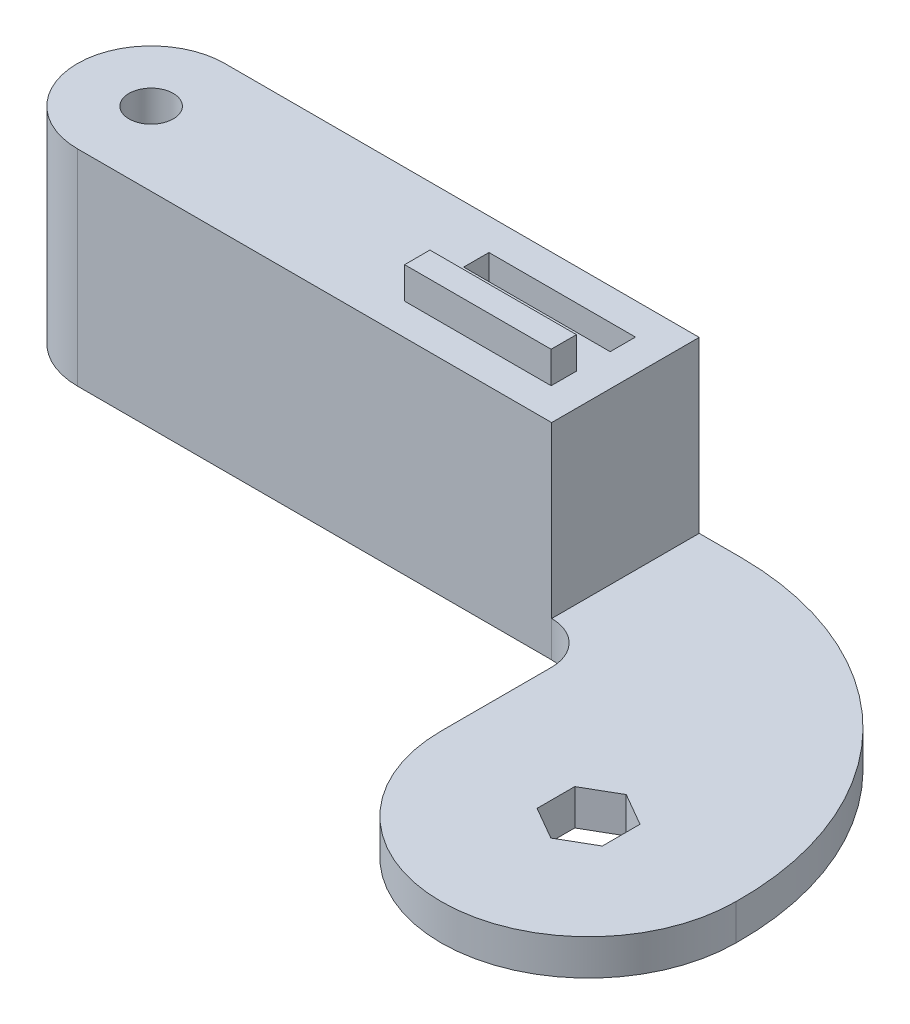
ISO-10303-21;
HEADER;
FILE_DESCRIPTION(('STEP AP214'),'2;1');
FILE_NAME('part.step','',(''),(''),'','','');
FILE_SCHEMA(('AUTOMOTIVE_DESIGN { 1 0 10303 214 1 1 1 1 }'));
ENDSEC;
DATA;
#1=APPLICATION_CONTEXT('core data for automotive mechanical design processes');
#2=APPLICATION_PROTOCOL_DEFINITION('international standard','automotive_design',2000,#1);
#3=PRODUCT_CONTEXT('',#1,'mechanical');
#4=PRODUCT('Part','Part','',(#3));
#5=PRODUCT_RELATED_PRODUCT_CATEGORY('part','',(#4));
#6=PRODUCT_DEFINITION_FORMATION('','',#4);
#7=PRODUCT_DEFINITION_CONTEXT('part definition',#1,'design');
#8=PRODUCT_DEFINITION('design','',#6,#7);
#9=PRODUCT_DEFINITION_SHAPE('','',#8);
#10=(LENGTH_UNIT() NAMED_UNIT(*) SI_UNIT(.MILLI.,.METRE.));
#11=(NAMED_UNIT(*) PLANE_ANGLE_UNIT() SI_UNIT($,.RADIAN.));
#12=(NAMED_UNIT(*) SI_UNIT($,.STERADIAN.) SOLID_ANGLE_UNIT());
#13=UNCERTAINTY_MEASURE_WITH_UNIT(LENGTH_MEASURE(1.E-05),#10,'distance_accuracy_value','');
#14=(GEOMETRIC_REPRESENTATION_CONTEXT(3) GLOBAL_UNCERTAINTY_ASSIGNED_CONTEXT((#13)) GLOBAL_UNIT_ASSIGNED_CONTEXT((#10,
#11,#12)) REPRESENTATION_CONTEXT('',''));
#15=CARTESIAN_POINT('',(0.,0.,0.));
#16=DIRECTION('',(0.,0.,1.));
#17=DIRECTION('',(1.,0.,0.));
#18=AXIS2_PLACEMENT_3D('',#15,#16,#17);
#19=CARTESIAN_POINT('',(0.,6.8,-29.));
#20=DIRECTION('',(0.,0.,1.));
#21=DIRECTION('',(1.,0.,0.));
#22=AXIS2_PLACEMENT_3D('',#19,#20,#21);
#23=PLANE('',#22);
#24=DIRECTION('',(1.,0.,0.));
#25=VECTOR('',#24,1.);
#26=CARTESIAN_POINT('',(-140.,39.,-29.));
#27=LINE('',#26,#25);
#28=CARTESIAN_POINT('',(-126.,39.,-29.));
#29=VERTEX_POINT('',#28);
#30=CARTESIAN_POINT('',(-36.,39.,-29.));
#31=VERTEX_POINT('',#30);
#32=EDGE_CURVE('E328',#29,#31,#27,.T.);
#33=ORIENTED_EDGE('',*,*,#32,.F.);
#34=DIRECTION('',(0.,-1.,0.));
#35=VECTOR('',#34,1.);
#36=CARTESIAN_POINT('',(-126.,6.8,-29.));
#37=LINE('',#36,#35);
#38=CARTESIAN_POINT('',(-126.,0.,-29.));
#39=VERTEX_POINT('',#38);
#40=EDGE_CURVE('E428',#29,#39,#37,.T.);
#41=ORIENTED_EDGE('',*,*,#40,.T.);
#42=DIRECTION('',(-1.,0.,0.));
#43=VECTOR('',#42,1.);
#44=CARTESIAN_POINT('',(0.,0.,-29.));
#45=LINE('',#44,#43);
#46=CARTESIAN_POINT('',(-36.,0.,-29.));
#47=VERTEX_POINT('',#46);
#48=EDGE_CURVE('E362',#47,#39,#45,.T.);
#49=ORIENTED_EDGE('',*,*,#48,.F.);
#50=DIRECTION('',(0.,-1.,0.));
#51=VECTOR('',#50,1.);
#52=CARTESIAN_POINT('',(-36.,6.8,-29.));
#53=LINE('',#52,#51);
#54=CARTESIAN_POINT('',(-36.,6.8,-29.));
#55=VERTEX_POINT('',#54);
#56=EDGE_CURVE('E408',#55,#47,#53,.T.);
#57=ORIENTED_EDGE('',*,*,#56,.F.);
#58=DIRECTION('',(0.,-1.,0.));
#59=VECTOR('',#58,1.);
#60=CARTESIAN_POINT('',(-36.,39.,-29.));
#61=LINE('',#60,#59);
#62=EDGE_CURVE('E339',#31,#55,#61,.T.);
#63=ORIENTED_EDGE('',*,*,#62,.F.);
#64=EDGE_LOOP('',(#33,#41,#49,#57,#63));
#65=FACE_BOUND('',#64,.T.);
#66=ADVANCED_FACE('F37',(#65),#23,.T.);
#67=CARTESIAN_POINT('',(-36.,6.8,-21.));
#68=DIRECTION('',(0.,-1.,0.));
#69=DIRECTION('',(0.,0.,-1.));
#70=AXIS2_PLACEMENT_3D('',#67,#68,#69);
#71=CYLINDRICAL_SURFACE('',#70,8.00000000000001);
#72=CARTESIAN_POINT('',(-36.,0.,-21.));
#73=DIRECTION('',(0.,1.,0.));
#74=DIRECTION('',(0.,0.,1.));
#75=AXIS2_PLACEMENT_3D('',#72,#73,#74);
#76=CIRCLE('',#75,8.00000000000001);
#77=CARTESIAN_POINT('',(-28.,0.,-21.));
#78=VERTEX_POINT('',#77);
#79=EDGE_CURVE('E388',#47,#78,#76,.F.);
#80=ORIENTED_EDGE('',*,*,#79,.T.);
#81=DIRECTION('',(0.,-1.,0.));
#82=VECTOR('',#81,1.);
#83=CARTESIAN_POINT('',(-28.,6.8,-21.));
#84=LINE('',#83,#82);
#85=CARTESIAN_POINT('',(-28.,6.8,-21.));
#86=VERTEX_POINT('',#85);
#87=EDGE_CURVE('E406',#86,#78,#84,.T.);
#88=ORIENTED_EDGE('',*,*,#87,.F.);
#89=CARTESIAN_POINT('',(-36.,6.8,-21.));
#90=DIRECTION('',(0.,1.,0.));
#91=DIRECTION('',(0.,0.,1.));
#92=AXIS2_PLACEMENT_3D('',#89,#90,#91);
#93=CIRCLE('',#92,8.00000000000001);
#94=EDGE_CURVE('E373',#55,#86,#93,.F.);
#95=ORIENTED_EDGE('',*,*,#94,.F.);
#96=ORIENTED_EDGE('',*,*,#56,.T.);
#97=EDGE_LOOP('',(#80,#88,#95,#96));
#98=FACE_BOUND('',#97,.T.);
#99=ADVANCED_FACE('F473',(#98),#71,.F.);
#100=CARTESIAN_POINT('',(-28.,6.8,0.));
#101=DIRECTION('',(-1.,0.,0.));
#102=DIRECTION('',(0.,0.,1.));
#103=AXIS2_PLACEMENT_3D('',#100,#101,#102);
#104=PLANE('',#103);
#105=DIRECTION('',(0.,0.,-1.));
#106=VECTOR('',#105,1.);
#107=CARTESIAN_POINT('',(-28.,0.,0.));
#108=LINE('',#107,#106);
#109=CARTESIAN_POINT('',(-28.,0.,0.));
#110=VERTEX_POINT('',#109);
#111=EDGE_CURVE('E391',#110,#78,#108,.T.);
#112=ORIENTED_EDGE('',*,*,#111,.F.);
#113=DIRECTION('',(0.,-1.,0.));
#114=VECTOR('',#113,1.);
#115=CARTESIAN_POINT('',(-28.,6.8,0.));
#116=LINE('',#115,#114);
#117=CARTESIAN_POINT('',(-28.,6.8,0.));
#118=VERTEX_POINT('',#117);
#119=EDGE_CURVE('E404',#118,#110,#116,.T.);
#120=ORIENTED_EDGE('',*,*,#119,.F.);
#121=DIRECTION('',(0.,0.,-1.));
#122=VECTOR('',#121,1.);
#123=CARTESIAN_POINT('',(-28.,6.8,0.));
#124=LINE('',#123,#122);
#125=EDGE_CURVE('E375',#118,#86,#124,.T.);
#126=ORIENTED_EDGE('',*,*,#125,.T.);
#127=ORIENTED_EDGE('',*,*,#87,.T.);
#128=EDGE_LOOP('',(#112,#120,#126,#127));
#129=FACE_BOUND('',#128,.T.);
#130=ADVANCED_FACE('F478',(#129),#104,.T.);
#131=CARTESIAN_POINT('',(0.,6.8,0.));
#132=DIRECTION('',(0.,-1.,0.));
#133=DIRECTION('',(0.,0.,-1.));
#134=AXIS2_PLACEMENT_3D('',#131,#132,#133);
#135=CYLINDRICAL_SURFACE('',#134,28.);
#136=CARTESIAN_POINT('',(0.,0.,0.));
#137=DIRECTION('',(0.,1.,0.));
#138=DIRECTION('',(0.,0.,1.));
#139=AXIS2_PLACEMENT_3D('',#136,#137,#138);
#140=CIRCLE('',#139,28.);
#141=CARTESIAN_POINT('',(28.,0.,0.));
#142=VERTEX_POINT('',#141);
#143=EDGE_CURVE('E394',#110,#142,#140,.T.);
#144=ORIENTED_EDGE('',*,*,#143,.T.);
#145=DIRECTION('',(0.,-1.,0.));
#146=VECTOR('',#145,1.);
#147=CARTESIAN_POINT('',(28.,6.8,0.));
#148=LINE('',#147,#146);
#149=CARTESIAN_POINT('',(28.,6.8,0.));
#150=VERTEX_POINT('',#149);
#151=EDGE_CURVE('E401',#150,#142,#148,.T.);
#152=ORIENTED_EDGE('',*,*,#151,.F.);
#153=CARTESIAN_POINT('',(0.,6.8,0.));
#154=DIRECTION('',(0.,1.,0.));
#155=DIRECTION('',(0.,0.,1.));
#156=AXIS2_PLACEMENT_3D('',#153,#154,#155);
#157=CIRCLE('',#156,28.);
#158=EDGE_CURVE('E379',#118,#150,#157,.T.);
#159=ORIENTED_EDGE('',*,*,#158,.F.);
#160=ORIENTED_EDGE('',*,*,#119,.T.);
#161=EDGE_LOOP('',(#144,#152,#159,#160));
#162=FACE_BOUND('',#161,.T.);
#163=ADVANCED_FACE('F707',(#162),#135,.T.);
#164=CARTESIAN_POINT('',(-28.1946619349979,6.8,-0.799981256844204));
#165=DIRECTION('',(0.,-1.,0.));
#166=DIRECTION('',(0.,0.,-1.));
#167=AXIS2_PLACEMENT_3D('',#164,#165,#166);
#168=CYLINDRICAL_SURFACE('',#167,56.2003558707594);
#169=CARTESIAN_POINT('',(-28.1946619349979,0.,-0.799981256844204));
#170=DIRECTION('',(0.,1.,0.));
#171=DIRECTION('',(0.,0.,1.));
#172=AXIS2_PLACEMENT_3D('',#169,#170,#171);
#173=CIRCLE('',#172,56.2003558707594);
#174=CARTESIAN_POINT('',(-28.,0.,-57.));
#175=VERTEX_POINT('',#174);
#176=EDGE_CURVE('E396',#142,#175,#173,.T.);
#177=ORIENTED_EDGE('',*,*,#176,.T.);
#178=DIRECTION('',(0.,-1.,0.));
#179=VECTOR('',#178,1.);
#180=CARTESIAN_POINT('',(-28.,6.8,-57.));
#181=LINE('',#180,#179);
#182=CARTESIAN_POINT('',(-28.,6.8,-57.));
#183=VERTEX_POINT('',#182);
#184=EDGE_CURVE('E385',#183,#175,#181,.T.);
#185=ORIENTED_EDGE('',*,*,#184,.F.);
#186=CARTESIAN_POINT('',(-28.1946619349979,6.8,-0.799981256844204));
#187=DIRECTION('',(0.,1.,0.));
#188=DIRECTION('',(0.,0.,1.));
#189=AXIS2_PLACEMENT_3D('',#186,#187,#188);
#190=CIRCLE('',#189,56.2003558707594);
#191=EDGE_CURVE('E381',#150,#183,#190,.T.);
#192=ORIENTED_EDGE('',*,*,#191,.F.);
#193=ORIENTED_EDGE('',*,*,#151,.T.);
#194=EDGE_LOOP('',(#177,#185,#192,#193));
#195=FACE_BOUND('',#194,.T.);
#196=ADVANCED_FACE('F513',(#195),#168,.T.);
#197=CARTESIAN_POINT('',(0.,6.8,-57.));
#198=DIRECTION('',(0.,0.,1.));
#199=DIRECTION('',(1.,0.,0.));
#200=AXIS2_PLACEMENT_3D('',#197,#198,#199);
#201=PLANE('',#200);
#202=DIRECTION('',(-1.,0.,0.));
#203=VECTOR('',#202,1.);
#204=CARTESIAN_POINT('',(0.,0.,-57.));
#205=LINE('',#204,#203);
#206=CARTESIAN_POINT('',(-126.,0.,-57.));
#207=VERTEX_POINT('',#206);
#208=EDGE_CURVE('E376',#175,#207,#205,.T.);
#209=ORIENTED_EDGE('',*,*,#208,.T.);
#210=DIRECTION('',(0.,-1.,0.));
#211=VECTOR('',#210,1.);
#212=CARTESIAN_POINT('',(-126.,39.,-57.));
#213=LINE('',#212,#211);
#214=CARTESIAN_POINT('',(-126.,39.,-57.));
#215=VERTEX_POINT('',#214);
#216=EDGE_CURVE('E11',#207,#215,#213,.F.);
#217=ORIENTED_EDGE('',*,*,#216,.T.);
#218=DIRECTION('',(-1.,0.,0.));
#219=VECTOR('',#218,1.);
#220=CARTESIAN_POINT('',(-140.,39.,-57.));
#221=LINE('',#220,#219);
#222=CARTESIAN_POINT('',(-36.,39.,-57.));
#223=VERTEX_POINT('',#222);
#224=EDGE_CURVE('E332',#223,#215,#221,.T.);
#225=ORIENTED_EDGE('',*,*,#224,.F.);
#226=DIRECTION('',(0.,-1.,0.));
#227=VECTOR('',#226,1.);
#228=CARTESIAN_POINT('',(-36.,39.,-57.));
#229=LINE('',#228,#227);
#230=CARTESIAN_POINT('',(-36.,6.8,-57.));
#231=VERTEX_POINT('',#230);
#232=EDGE_CURVE('E334',#223,#231,#229,.T.);
#233=ORIENTED_EDGE('',*,*,#232,.T.);
#234=DIRECTION('',(-1.,0.,0.));
#235=VECTOR('',#234,1.);
#236=CARTESIAN_POINT('',(0.,6.8,-57.));
#237=LINE('',#236,#235);
#238=EDGE_CURVE('E383',#183,#231,#237,.T.);
#239=ORIENTED_EDGE('',*,*,#238,.F.);
#240=ORIENTED_EDGE('',*,*,#184,.T.);
#241=EDGE_LOOP('',(#209,#217,#225,#233,#239,#240));
#242=FACE_BOUND('',#241,.T.);
#243=ADVANCED_FACE('F508',(#242),#201,.F.);
#244=CARTESIAN_POINT('',(0.,6.8,0.));
#245=DIRECTION('',(0.,1.,0.));
#246=DIRECTION('',(0.,0.,1.));
#247=AXIS2_PLACEMENT_3D('',#244,#245,#246);
#248=PLANE('',#247);
#249=DIRECTION('',(0.,0.,-1.));
#250=VECTOR('',#249,1.);
#251=CARTESIAN_POINT('',(-36.,6.8,-29.));
#252=LINE('',#251,#250);
#253=EDGE_CURVE('E321',#55,#231,#252,.T.);
#254=ORIENTED_EDGE('',*,*,#253,.F.);
#255=ORIENTED_EDGE('',*,*,#94,.T.);
#256=ORIENTED_EDGE('',*,*,#125,.F.);
#257=ORIENTED_EDGE('',*,*,#158,.T.);
#258=ORIENTED_EDGE('',*,*,#191,.T.);
#259=ORIENTED_EDGE('',*,*,#238,.T.);
#260=EDGE_LOOP('',(#254,#255,#256,#257,#258,#259));
#261=FACE_BOUND('',#260,.T.);
#262=DIRECTION('',(-0.866025403784439,0.,-0.5));
#263=VECTOR('',#262,1.);
#264=CARTESIAN_POINT('',(6.19208163705873,6.8,-3.575));
#265=LINE('',#264,#263);
#266=CARTESIAN_POINT('',(6.19208163705873,6.8,-3.575));
#267=VERTEX_POINT('',#266);
#268=CARTESIAN_POINT('',(0.,6.8,-7.15));
#269=VERTEX_POINT('',#268);
#270=EDGE_CURVE('E342',#267,#269,#265,.T.);
#271=ORIENTED_EDGE('',*,*,#270,.F.);
#272=DIRECTION('',(0.,0.,-1.));
#273=VECTOR('',#272,1.);
#274=CARTESIAN_POINT('',(6.19208163705873,6.8,3.575));
#275=LINE('',#274,#273);
#276=CARTESIAN_POINT('',(6.19208163705873,6.8,3.575));
#277=VERTEX_POINT('',#276);
#278=EDGE_CURVE('E356',#277,#267,#275,.T.);
#279=ORIENTED_EDGE('',*,*,#278,.F.);
#280=DIRECTION('',(0.866025403784439,0.,-0.5));
#281=VECTOR('',#280,1.);
#282=CARTESIAN_POINT('',(0.,6.8,7.15));
#283=LINE('',#282,#281);
#284=CARTESIAN_POINT('',(0.,6.8,7.15));
#285=VERTEX_POINT('',#284);
#286=EDGE_CURVE('E353',#285,#277,#283,.T.);
#287=ORIENTED_EDGE('',*,*,#286,.F.);
#288=DIRECTION('',(0.866025403784439,0.,0.5));
#289=VECTOR('',#288,1.);
#290=CARTESIAN_POINT('',(-6.19208163705874,6.8,3.575));
#291=LINE('',#290,#289);
#292=CARTESIAN_POINT('',(-6.19208163705874,6.8,3.575));
#293=VERTEX_POINT('',#292);
#294=EDGE_CURVE('E350',#293,#285,#291,.T.);
#295=ORIENTED_EDGE('',*,*,#294,.F.);
#296=DIRECTION('',(0.,0.,1.));
#297=VECTOR('',#296,1.);
#298=CARTESIAN_POINT('',(-6.19208163705874,6.8,-3.575));
#299=LINE('',#298,#297);
#300=CARTESIAN_POINT('',(-6.19208163705874,6.8,-3.575));
#301=VERTEX_POINT('',#300);
#302=EDGE_CURVE('E347',#301,#293,#299,.T.);
#303=ORIENTED_EDGE('',*,*,#302,.F.);
#304=DIRECTION('',(-0.866025403784439,0.,0.5));
#305=VECTOR('',#304,1.);
#306=CARTESIAN_POINT('',(0.,6.8,-7.15));
#307=LINE('',#306,#305);
#308=EDGE_CURVE('E344',#269,#301,#307,.T.);
#309=ORIENTED_EDGE('',*,*,#308,.F.);
#310=EDGE_LOOP('',(#271,#279,#287,#295,#303,#309));
#311=FACE_BOUND('',#310,.T.);
#312=ADVANCED_FACE('F512',(#261,#311),#248,.T.);
#313=CARTESIAN_POINT('',(0.,0.,0.));
#314=DIRECTION('',(0.,1.,0.));
#315=DIRECTION('',(0.,0.,1.));
#316=AXIS2_PLACEMENT_3D('',#313,#314,#315);
#317=PLANE('',#316);
#318=DIRECTION('',(1.,0.,0.));
#319=VECTOR('',#318,1.);
#320=CARTESIAN_POINT('',(-133.,0.,-50.));
#321=LINE('',#320,#319);
#322=CARTESIAN_POINT('',(-133.,0.,-50.));
#323=VERTEX_POINT('',#322);
#324=CARTESIAN_POINT('',(-119.,0.,-50.));
#325=VERTEX_POINT('',#324);
#326=EDGE_CURVE('E255',#323,#325,#321,.T.);
#327=ORIENTED_EDGE('',*,*,#326,.F.);
#328=DIRECTION('',(0.,0.,-1.));
#329=VECTOR('',#328,1.);
#330=CARTESIAN_POINT('',(-133.,0.,-36.));
#331=LINE('',#330,#329);
#332=CARTESIAN_POINT('',(-133.,0.,-36.));
#333=VERTEX_POINT('',#332);
#334=EDGE_CURVE('E227',#333,#323,#331,.T.);
#335=ORIENTED_EDGE('',*,*,#334,.F.);
#336=DIRECTION('',(-1.,0.,0.));
#337=VECTOR('',#336,1.);
#338=CARTESIAN_POINT('',(-133.,0.,-36.));
#339=LINE('',#338,#337);
#340=CARTESIAN_POINT('',(-119.,0.,-36.));
#341=VERTEX_POINT('',#340);
#342=EDGE_CURVE('E244',#341,#333,#339,.T.);
#343=ORIENTED_EDGE('',*,*,#342,.F.);
#344=DIRECTION('',(0.,0.,1.));
#345=VECTOR('',#344,1.);
#346=CARTESIAN_POINT('',(-119.,0.,-36.));
#347=LINE('',#346,#345);
#348=EDGE_CURVE('E247',#325,#341,#347,.T.);
#349=ORIENTED_EDGE('',*,*,#348,.F.);
#350=EDGE_LOOP('',(#327,#335,#343,#349));
#351=FACE_BOUND('',#350,.T.);
#352=DIRECTION('',(0.,0.,-1.));
#353=VECTOR('',#352,1.);
#354=CARTESIAN_POINT('',(6.19208163705873,0.,0.));
#355=LINE('',#354,#353);
#356=CARTESIAN_POINT('',(6.19208163705873,0.,3.575));
#357=VERTEX_POINT('',#356);
#358=CARTESIAN_POINT('',(6.19208163705873,0.,-3.575));
#359=VERTEX_POINT('',#358);
#360=EDGE_CURVE('E422',#357,#359,#355,.T.);
#361=ORIENTED_EDGE('',*,*,#360,.T.);
#362=DIRECTION('',(-0.866025403784439,0.,-0.5));
#363=VECTOR('',#362,1.);
#364=CARTESIAN_POINT('',(3.09604081852937,0.,-5.3625));
#365=LINE('',#364,#363);
#366=CARTESIAN_POINT('',(0.,0.,-7.15));
#367=VERTEX_POINT('',#366);
#368=EDGE_CURVE('E425',#359,#367,#365,.T.);
#369=ORIENTED_EDGE('',*,*,#368,.T.);
#370=DIRECTION('',(-0.866025403784439,0.,0.5));
#371=VECTOR('',#370,1.);
#372=CARTESIAN_POINT('',(-3.09604081852937,0.,-5.3625));
#373=LINE('',#372,#371);
#374=CARTESIAN_POINT('',(-6.19208163705874,0.,-3.575));
#375=VERTEX_POINT('',#374);
#376=EDGE_CURVE('E410',#367,#375,#373,.T.);
#377=ORIENTED_EDGE('',*,*,#376,.T.);
#378=DIRECTION('',(0.,0.,1.));
#379=VECTOR('',#378,1.);
#380=CARTESIAN_POINT('',(-6.19208163705874,0.,0.));
#381=LINE('',#380,#379);
#382=CARTESIAN_POINT('',(-6.19208163705874,0.,3.575));
#383=VERTEX_POINT('',#382);
#384=EDGE_CURVE('E413',#375,#383,#381,.T.);
#385=ORIENTED_EDGE('',*,*,#384,.T.);
#386=DIRECTION('',(0.866025403784439,0.,0.5));
#387=VECTOR('',#386,1.);
#388=CARTESIAN_POINT('',(-3.09604081852937,0.,5.3625));
#389=LINE('',#388,#387);
#390=CARTESIAN_POINT('',(0.,0.,7.15));
#391=VERTEX_POINT('',#390);
#392=EDGE_CURVE('E416',#383,#391,#389,.T.);
#393=ORIENTED_EDGE('',*,*,#392,.T.);
#394=DIRECTION('',(0.866025403784439,0.,-0.5));
#395=VECTOR('',#394,1.);
#396=CARTESIAN_POINT('',(3.09604081852937,0.,5.3625));
#397=LINE('',#396,#395);
#398=EDGE_CURVE('E419',#391,#357,#397,.T.);
#399=ORIENTED_EDGE('',*,*,#398,.T.);
#400=EDGE_LOOP('',(#361,#369,#377,#385,#393,#399));
#401=FACE_BOUND('',#400,.T.);
#402=ORIENTED_EDGE('',*,*,#48,.T.);
#403=CARTESIAN_POINT('',(-126.,0.,-43.));
#404=DIRECTION('',(0.,1.,0.));
#405=DIRECTION('',(0.,0.,1.));
#406=AXIS2_PLACEMENT_3D('',#403,#404,#405);
#407=CIRCLE('',#406,14.);
#408=CARTESIAN_POINT('',(-140.,0.,-43.));
#409=VERTEX_POINT('',#408);
#410=EDGE_CURVE('E435',#39,#409,#407,.F.);
#411=ORIENTED_EDGE('',*,*,#410,.T.);
#412=CARTESIAN_POINT('',(-126.,0.,-43.));
#413=DIRECTION('',(0.,1.,0.));
#414=DIRECTION('',(0.,0.,1.));
#415=AXIS2_PLACEMENT_3D('',#412,#413,#414);
#416=CIRCLE('',#415,14.);
#417=EDGE_CURVE('E433',#409,#207,#416,.F.);
#418=ORIENTED_EDGE('',*,*,#417,.T.);
#419=ORIENTED_EDGE('',*,*,#208,.F.);
#420=ORIENTED_EDGE('',*,*,#176,.F.);
#421=ORIENTED_EDGE('',*,*,#143,.F.);
#422=ORIENTED_EDGE('',*,*,#111,.T.);
#423=ORIENTED_EDGE('',*,*,#79,.F.);
#424=EDGE_LOOP('',(#402,#411,#418,#419,#420,#421,#422,#423));
#425=FACE_BOUND('',#424,.T.);
#426=ADVANCED_FACE('F452',(#351,#401,#425),#317,.F.);
#427=CARTESIAN_POINT('',(6.19208163705873,-0.100000000000001,-3.575));
#428=DIRECTION('',(0.5,0.,-0.866025403784439));
#429=DIRECTION('',(-0.866025403784439,0.,-0.5));
#430=AXIS2_PLACEMENT_3D('',#427,#428,#429);
#431=PLANE('',#430);
#432=DIRECTION('',(0.,1.,0.));
#433=VECTOR('',#432,1.);
#434=CARTESIAN_POINT('',(6.19208163705873,-0.100000000000001,-3.575));
#435=LINE('',#434,#433);
#436=EDGE_CURVE('E360',#359,#267,#435,.T.);
#437=ORIENTED_EDGE('',*,*,#436,.T.);
#438=ORIENTED_EDGE('',*,*,#270,.T.);
#439=DIRECTION('',(0.,1.,0.));
#440=VECTOR('',#439,1.);
#441=CARTESIAN_POINT('',(0.,-0.100000000000001,-7.15));
#442=LINE('',#441,#440);
#443=EDGE_CURVE('E359',#367,#269,#442,.T.);
#444=ORIENTED_EDGE('',*,*,#443,.F.);
#445=ORIENTED_EDGE('',*,*,#368,.F.);
#446=EDGE_LOOP('',(#437,#438,#444,#445));
#447=FACE_BOUND('',#446,.T.);
#448=ADVANCED_FACE('F525',(#447),#431,.F.);
#449=CARTESIAN_POINT('',(6.19208163705873,-0.100000000000001,3.575));
#450=DIRECTION('',(1.,0.,0.));
#451=DIRECTION('',(0.,0.,-1.));
#452=AXIS2_PLACEMENT_3D('',#449,#450,#451);
#453=PLANE('',#452);
#454=DIRECTION('',(0.,1.,0.));
#455=VECTOR('',#454,1.);
#456=CARTESIAN_POINT('',(6.19208163705873,-0.100000000000001,3.575));
#457=LINE('',#456,#455);
#458=EDGE_CURVE('E363',#357,#277,#457,.T.);
#459=ORIENTED_EDGE('',*,*,#458,.T.);
#460=ORIENTED_EDGE('',*,*,#278,.T.);
#461=ORIENTED_EDGE('',*,*,#436,.F.);
#462=ORIENTED_EDGE('',*,*,#360,.F.);
#463=EDGE_LOOP('',(#459,#460,#461,#462));
#464=FACE_BOUND('',#463,.T.);
#465=ADVANCED_FACE('F684',(#464),#453,.F.);
#466=CARTESIAN_POINT('',(0.,-0.100000000000001,7.15));
#467=DIRECTION('',(0.5,0.,0.866025403784439));
#468=DIRECTION('',(0.866025403784439,0.,-0.5));
#469=AXIS2_PLACEMENT_3D('',#466,#467,#468);
#470=PLANE('',#469);
#471=DIRECTION('',(0.,1.,0.));
#472=VECTOR('',#471,1.);
#473=CARTESIAN_POINT('',(0.,-0.100000000000001,7.15));
#474=LINE('',#473,#472);
#475=EDGE_CURVE('E365',#391,#285,#474,.T.);
#476=ORIENTED_EDGE('',*,*,#475,.T.);
#477=ORIENTED_EDGE('',*,*,#286,.T.);
#478=ORIENTED_EDGE('',*,*,#458,.F.);
#479=ORIENTED_EDGE('',*,*,#398,.F.);
#480=EDGE_LOOP('',(#476,#477,#478,#479));
#481=FACE_BOUND('',#480,.T.);
#482=ADVANCED_FACE('F687',(#481),#470,.F.);
#483=CARTESIAN_POINT('',(-6.19208163705874,-0.100000000000001,3.575));
#484=DIRECTION('',(-0.5,0.,0.866025403784439));
#485=DIRECTION('',(0.866025403784439,0.,0.5));
#486=AXIS2_PLACEMENT_3D('',#483,#484,#485);
#487=PLANE('',#486);
#488=DIRECTION('',(0.,1.,0.));
#489=VECTOR('',#488,1.);
#490=CARTESIAN_POINT('',(-6.19208163705874,-0.100000000000001,3.575));
#491=LINE('',#490,#489);
#492=EDGE_CURVE('E367',#383,#293,#491,.T.);
#493=ORIENTED_EDGE('',*,*,#492,.T.);
#494=ORIENTED_EDGE('',*,*,#294,.T.);
#495=ORIENTED_EDGE('',*,*,#475,.F.);
#496=ORIENTED_EDGE('',*,*,#392,.F.);
#497=EDGE_LOOP('',(#493,#494,#495,#496));
#498=FACE_BOUND('',#497,.T.);
#499=ADVANCED_FACE('F691',(#498),#487,.F.);
#500=CARTESIAN_POINT('',(-6.19208163705874,-0.100000000000001,-3.575));
#501=DIRECTION('',(-1.,0.,0.));
#502=DIRECTION('',(0.,0.,1.));
#503=AXIS2_PLACEMENT_3D('',#500,#501,#502);
#504=PLANE('',#503);
#505=DIRECTION('',(0.,1.,0.));
#506=VECTOR('',#505,1.);
#507=CARTESIAN_POINT('',(-6.19208163705874,-0.100000000000001,-3.575));
#508=LINE('',#507,#506);
#509=EDGE_CURVE('E369',#375,#301,#508,.T.);
#510=ORIENTED_EDGE('',*,*,#509,.T.);
#511=ORIENTED_EDGE('',*,*,#302,.T.);
#512=ORIENTED_EDGE('',*,*,#492,.F.);
#513=ORIENTED_EDGE('',*,*,#384,.F.);
#514=EDGE_LOOP('',(#510,#511,#512,#513));
#515=FACE_BOUND('',#514,.T.);
#516=ADVANCED_FACE('F695',(#515),#504,.F.);
#517=CARTESIAN_POINT('',(0.,-0.100000000000001,-7.15));
#518=DIRECTION('',(-0.5,0.,-0.866025403784439));
#519=DIRECTION('',(-0.866025403784439,0.,0.5));
#520=AXIS2_PLACEMENT_3D('',#517,#518,#519);
#521=PLANE('',#520);
#522=ORIENTED_EDGE('',*,*,#443,.T.);
#523=ORIENTED_EDGE('',*,*,#308,.T.);
#524=ORIENTED_EDGE('',*,*,#509,.F.);
#525=ORIENTED_EDGE('',*,*,#376,.F.);
#526=EDGE_LOOP('',(#522,#523,#524,#525));
#527=FACE_BOUND('',#526,.T.);
#528=ADVANCED_FACE('F682',(#527),#521,.F.);
#529=CARTESIAN_POINT('',(-36.,39.,-29.));
#530=DIRECTION('',(-1.,0.,0.));
#531=DIRECTION('',(0.,0.,1.));
#532=AXIS2_PLACEMENT_3D('',#529,#530,#531);
#533=PLANE('',#532);
#534=ORIENTED_EDGE('',*,*,#253,.T.);
#535=ORIENTED_EDGE('',*,*,#232,.F.);
#536=DIRECTION('',(0.,0.,-1.));
#537=VECTOR('',#536,1.);
#538=CARTESIAN_POINT('',(-36.,39.,-29.));
#539=LINE('',#538,#537);
#540=EDGE_CURVE('E330',#31,#223,#539,.T.);
#541=ORIENTED_EDGE('',*,*,#540,.F.);
#542=ORIENTED_EDGE('',*,*,#62,.T.);
#543=EDGE_LOOP('',(#534,#535,#541,#542));
#544=FACE_BOUND('',#543,.T.);
#545=ADVANCED_FACE('F538',(#544),#533,.F.);
#546=CARTESIAN_POINT('',(0.,39.,0.));
#547=DIRECTION('',(0.,-1.,0.));
#548=DIRECTION('',(0.,0.,-1.));
#549=AXIS2_PLACEMENT_3D('',#546,#547,#548);
#550=PLANE('',#549);
#551=CARTESIAN_POINT('',(-126.,39.,-43.));
#552=DIRECTION('',(0.,-1.,0.));
#553=DIRECTION('',(0.,0.,-1.));
#554=AXIS2_PLACEMENT_3D('',#551,#552,#553);
#555=CIRCLE('',#554,4.2);
#556=CARTESIAN_POINT('',(-126.,39.,-47.2));
#557=VERTEX_POINT('',#556);
#558=EDGE_CURVE('E256',#557,#557,#555,.T.);
#559=ORIENTED_EDGE('',*,*,#558,.T.);
#560=EDGE_LOOP('',(#559));
#561=FACE_BOUND('',#560,.T.);
#562=DIRECTION('',(-1.,0.,0.));
#563=VECTOR('',#562,1.);
#564=CARTESIAN_POINT('',(0.,39.,-35.));
#565=LINE('',#564,#563);
#566=CARTESIAN_POINT('',(-42.1,39.,-35.));
#567=VERTEX_POINT('',#566);
#568=CARTESIAN_POINT('',(-69.9,39.,-35.));
#569=VERTEX_POINT('',#568);
#570=EDGE_CURVE('E279',#567,#569,#565,.T.);
#571=ORIENTED_EDGE('',*,*,#570,.T.);
#572=DIRECTION('',(0.,0.,-1.));
#573=VECTOR('',#572,1.);
#574=CARTESIAN_POINT('',(-69.9,39.,0.));
#575=LINE('',#574,#573);
#576=CARTESIAN_POINT('',(-69.9,39.,-39.8));
#577=VERTEX_POINT('',#576);
#578=EDGE_CURVE('E262',#569,#577,#575,.T.);
#579=ORIENTED_EDGE('',*,*,#578,.T.);
#580=DIRECTION('',(-1.,0.,0.));
#581=VECTOR('',#580,1.);
#582=CARTESIAN_POINT('',(0.,39.,-39.8));
#583=LINE('',#582,#581);
#584=CARTESIAN_POINT('',(-42.1,39.,-39.8));
#585=VERTEX_POINT('',#584);
#586=EDGE_CURVE('E270',#585,#577,#583,.T.);
#587=ORIENTED_EDGE('',*,*,#586,.F.);
#588=DIRECTION('',(0.,0.,-1.));
#589=VECTOR('',#588,1.);
#590=CARTESIAN_POINT('',(-42.1000000000001,39.,0.));
#591=LINE('',#590,#589);
#592=EDGE_CURVE('E281',#567,#585,#591,.T.);
#593=ORIENTED_EDGE('',*,*,#592,.F.);
#594=EDGE_LOOP('',(#571,#579,#587,#593));
#595=FACE_BOUND('',#594,.T.);
#596=DIRECTION('',(0.,0.,1.));
#597=VECTOR('',#596,1.);
#598=CARTESIAN_POINT('',(-69.9,39.,0.));
#599=LINE('',#598,#597);
#600=CARTESIAN_POINT('',(-69.9,39.,-51.));
#601=VERTEX_POINT('',#600);
#602=CARTESIAN_POINT('',(-69.9,39.,-46.2));
#603=VERTEX_POINT('',#602);
#604=EDGE_CURVE('E311',#601,#603,#599,.T.);
#605=ORIENTED_EDGE('',*,*,#604,.F.);
#606=DIRECTION('',(-1.,0.,0.));
#607=VECTOR('',#606,1.);
#608=CARTESIAN_POINT('',(0.,39.,-51.));
#609=LINE('',#608,#607);
#610=CARTESIAN_POINT('',(-42.1,39.,-51.));
#611=VERTEX_POINT('',#610);
#612=EDGE_CURVE('E297',#611,#601,#609,.T.);
#613=ORIENTED_EDGE('',*,*,#612,.F.);
#614=DIRECTION('',(0.,0.,1.));
#615=VECTOR('',#614,1.);
#616=CARTESIAN_POINT('',(-42.1,39.,0.));
#617=LINE('',#616,#615);
#618=CARTESIAN_POINT('',(-42.1,39.,-46.2));
#619=VERTEX_POINT('',#618);
#620=EDGE_CURVE('E302',#611,#619,#617,.T.);
#621=ORIENTED_EDGE('',*,*,#620,.T.);
#622=DIRECTION('',(-1.,0.,0.));
#623=VECTOR('',#622,1.);
#624=CARTESIAN_POINT('',(0.,39.,-46.2));
#625=LINE('',#624,#623);
#626=EDGE_CURVE('E314',#619,#603,#625,.T.);
#627=ORIENTED_EDGE('',*,*,#626,.T.);
#628=EDGE_LOOP('',(#605,#613,#621,#627));
#629=FACE_BOUND('',#628,.T.);
#630=CARTESIAN_POINT('',(-126.,39.,-43.));
#631=DIRECTION('',(0.,-1.,0.));
#632=DIRECTION('',(0.,0.,-1.));
#633=AXIS2_PLACEMENT_3D('',#630,#631,#632);
#634=CIRCLE('',#633,14.);
#635=CARTESIAN_POINT('',(-140.,39.,-43.));
#636=VERTEX_POINT('',#635);
#637=EDGE_CURVE('E58',#215,#636,#634,.F.);
#638=ORIENTED_EDGE('',*,*,#637,.T.);
#639=CARTESIAN_POINT('',(-126.,39.,-43.));
#640=DIRECTION('',(0.,-1.,0.));
#641=DIRECTION('',(0.,0.,-1.));
#642=AXIS2_PLACEMENT_3D('',#639,#640,#641);
#643=CIRCLE('',#642,14.);
#644=EDGE_CURVE('E46',#636,#29,#643,.F.);
#645=ORIENTED_EDGE('',*,*,#644,.T.);
#646=ORIENTED_EDGE('',*,*,#32,.T.);
#647=ORIENTED_EDGE('',*,*,#540,.T.);
#648=ORIENTED_EDGE('',*,*,#224,.T.);
#649=EDGE_LOOP('',(#638,#645,#646,#647,#648));
#650=FACE_BOUND('',#649,.T.);
#651=ADVANCED_FACE('F440',(#561,#595,#629,#650),#550,.F.);
#652=CARTESIAN_POINT('',(0.,33.,-51.));
#653=DIRECTION('',(0.,0.,-1.));
#654=DIRECTION('',(-1.,0.,0.));
#655=AXIS2_PLACEMENT_3D('',#652,#653,#654);
#656=PLANE('',#655);
#657=ORIENTED_EDGE('',*,*,#612,.T.);
#658=DIRECTION('',(0.,1.,0.));
#659=VECTOR('',#658,1.);
#660=CARTESIAN_POINT('',(-69.9,33.,-51.));
#661=LINE('',#660,#659);
#662=CARTESIAN_POINT('',(-69.9,33.,-51.));
#663=VERTEX_POINT('',#662);
#664=EDGE_CURVE('E309',#663,#601,#661,.T.);
#665=ORIENTED_EDGE('',*,*,#664,.F.);
#666=DIRECTION('',(-1.,0.,0.));
#667=VECTOR('',#666,1.);
#668=CARTESIAN_POINT('',(0.,33.,-51.));
#669=LINE('',#668,#667);
#670=CARTESIAN_POINT('',(-42.1,33.,-51.));
#671=VERTEX_POINT('',#670);
#672=EDGE_CURVE('E298',#671,#663,#669,.T.);
#673=ORIENTED_EDGE('',*,*,#672,.F.);
#674=DIRECTION('',(0.,1.,0.));
#675=VECTOR('',#674,1.);
#676=CARTESIAN_POINT('',(-42.1,33.,-51.));
#677=LINE('',#676,#675);
#678=EDGE_CURVE('E319',#671,#611,#677,.T.);
#679=ORIENTED_EDGE('',*,*,#678,.T.);
#680=EDGE_LOOP('',(#657,#665,#673,#679));
#681=FACE_BOUND('',#680,.T.);
#682=ADVANCED_FACE('F537',(#681),#656,.F.);
#683=CARTESIAN_POINT('',(-42.1,33.,0.));
#684=DIRECTION('',(-1.,0.,0.));
#685=DIRECTION('',(0.,0.,1.));
#686=AXIS2_PLACEMENT_3D('',#683,#684,#685);
#687=PLANE('',#686);
#688=ORIENTED_EDGE('',*,*,#620,.F.);
#689=ORIENTED_EDGE('',*,*,#678,.F.);
#690=DIRECTION('',(0.,0.,1.));
#691=VECTOR('',#690,1.);
#692=CARTESIAN_POINT('',(-42.1,33.,0.));
#693=LINE('',#692,#691);
#694=CARTESIAN_POINT('',(-42.1,33.,-46.2));
#695=VERTEX_POINT('',#694);
#696=EDGE_CURVE('E307',#671,#695,#693,.T.);
#697=ORIENTED_EDGE('',*,*,#696,.T.);
#698=DIRECTION('',(0.,1.,0.));
#699=VECTOR('',#698,1.);
#700=CARTESIAN_POINT('',(-42.1,33.,-46.2));
#701=LINE('',#700,#699);
#702=EDGE_CURVE('E322',#695,#619,#701,.T.);
#703=ORIENTED_EDGE('',*,*,#702,.T.);
#704=EDGE_LOOP('',(#688,#689,#697,#703));
#705=FACE_BOUND('',#704,.T.);
#706=ADVANCED_FACE('F553',(#705),#687,.T.);
#707=CARTESIAN_POINT('',(0.,33.,-46.2));
#708=DIRECTION('',(0.,0.,-1.));
#709=DIRECTION('',(-1.,0.,0.));
#710=AXIS2_PLACEMENT_3D('',#707,#708,#709);
#711=PLANE('',#710);
#712=ORIENTED_EDGE('',*,*,#626,.F.);
#713=ORIENTED_EDGE('',*,*,#702,.F.);
#714=DIRECTION('',(-1.,0.,0.));
#715=VECTOR('',#714,1.);
#716=CARTESIAN_POINT('',(0.,33.,-46.2));
#717=LINE('',#716,#715);
#718=CARTESIAN_POINT('',(-69.9,33.,-46.2));
#719=VERTEX_POINT('',#718);
#720=EDGE_CURVE('E305',#695,#719,#717,.T.);
#721=ORIENTED_EDGE('',*,*,#720,.T.);
#722=DIRECTION('',(0.,1.,0.));
#723=VECTOR('',#722,1.);
#724=CARTESIAN_POINT('',(-69.9,33.,-46.2));
#725=LINE('',#724,#723);
#726=EDGE_CURVE('E324',#719,#603,#725,.T.);
#727=ORIENTED_EDGE('',*,*,#726,.T.);
#728=EDGE_LOOP('',(#712,#713,#721,#727));
#729=FACE_BOUND('',#728,.T.);
#730=ADVANCED_FACE('F560',(#729),#711,.T.);
#731=CARTESIAN_POINT('',(-69.9,33.,0.));
#732=DIRECTION('',(-1.,0.,0.));
#733=DIRECTION('',(0.,0.,1.));
#734=AXIS2_PLACEMENT_3D('',#731,#732,#733);
#735=PLANE('',#734);
#736=ORIENTED_EDGE('',*,*,#604,.T.);
#737=ORIENTED_EDGE('',*,*,#726,.F.);
#738=DIRECTION('',(0.,0.,1.));
#739=VECTOR('',#738,1.);
#740=CARTESIAN_POINT('',(-69.9,33.,0.));
#741=LINE('',#740,#739);
#742=EDGE_CURVE('E301',#663,#719,#741,.T.);
#743=ORIENTED_EDGE('',*,*,#742,.F.);
#744=ORIENTED_EDGE('',*,*,#664,.T.);
#745=EDGE_LOOP('',(#736,#737,#743,#744));
#746=FACE_BOUND('',#745,.T.);
#747=ADVANCED_FACE('F568',(#746),#735,.F.);
#748=CARTESIAN_POINT('',(0.,33.,0.));
#749=DIRECTION('',(0.,1.,0.));
#750=DIRECTION('',(0.,0.,1.));
#751=AXIS2_PLACEMENT_3D('',#748,#749,#750);
#752=PLANE('',#751);
#753=ORIENTED_EDGE('',*,*,#672,.T.);
#754=ORIENTED_EDGE('',*,*,#742,.T.);
#755=ORIENTED_EDGE('',*,*,#720,.F.);
#756=ORIENTED_EDGE('',*,*,#696,.F.);
#757=EDGE_LOOP('',(#753,#754,#755,#756));
#758=FACE_BOUND('',#757,.T.);
#759=ADVANCED_FACE('F576',(#758),#752,.T.);
#760=CARTESIAN_POINT('',(-69.9,45.,0.));
#761=DIRECTION('',(-1.,0.,0.));
#762=DIRECTION('',(0.,0.,1.));
#763=AXIS2_PLACEMENT_3D('',#760,#761,#762);
#764=PLANE('',#763);
#765=ORIENTED_EDGE('',*,*,#578,.F.);
#766=DIRECTION('',(0.,-1.,0.));
#767=VECTOR('',#766,1.);
#768=CARTESIAN_POINT('',(-69.9,45.,-35.));
#769=LINE('',#768,#767);
#770=CARTESIAN_POINT('',(-69.9,45.,-35.));
#771=VERTEX_POINT('',#770);
#772=EDGE_CURVE('E294',#771,#569,#769,.T.);
#773=ORIENTED_EDGE('',*,*,#772,.F.);
#774=DIRECTION('',(0.,0.,-1.));
#775=VECTOR('',#774,1.);
#776=CARTESIAN_POINT('',(-69.9,45.,0.));
#777=LINE('',#776,#775);
#778=CARTESIAN_POINT('',(-69.9,45.,-39.8));
#779=VERTEX_POINT('',#778);
#780=EDGE_CURVE('E266',#771,#779,#777,.T.);
#781=ORIENTED_EDGE('',*,*,#780,.T.);
#782=DIRECTION('',(0.,-1.,0.));
#783=VECTOR('',#782,1.);
#784=CARTESIAN_POINT('',(-69.9,45.,-39.8));
#785=LINE('',#784,#783);
#786=EDGE_CURVE('E277',#779,#577,#785,.T.);
#787=ORIENTED_EDGE('',*,*,#786,.T.);
#788=EDGE_LOOP('',(#765,#773,#781,#787));
#789=FACE_BOUND('',#788,.T.);
#790=ADVANCED_FACE('F584',(#789),#764,.T.);
#791=CARTESIAN_POINT('',(0.,45.,-35.));
#792=DIRECTION('',(0.,0.,1.));
#793=DIRECTION('',(1.,0.,0.));
#794=AXIS2_PLACEMENT_3D('',#791,#792,#793);
#795=PLANE('',#794);
#796=ORIENTED_EDGE('',*,*,#570,.F.);
#797=DIRECTION('',(0.,-1.,0.));
#798=VECTOR('',#797,1.);
#799=CARTESIAN_POINT('',(-42.1,45.,-35.));
#800=LINE('',#799,#798);
#801=CARTESIAN_POINT('',(-42.1,45.,-35.));
#802=VERTEX_POINT('',#801);
#803=EDGE_CURVE('E291',#802,#567,#800,.T.);
#804=ORIENTED_EDGE('',*,*,#803,.F.);
#805=DIRECTION('',(-1.,0.,0.));
#806=VECTOR('',#805,1.);
#807=CARTESIAN_POINT('',(0.,45.,-35.));
#808=LINE('',#807,#806);
#809=EDGE_CURVE('E269',#802,#771,#808,.T.);
#810=ORIENTED_EDGE('',*,*,#809,.T.);
#811=ORIENTED_EDGE('',*,*,#772,.T.);
#812=EDGE_LOOP('',(#796,#804,#810,#811));
#813=FACE_BOUND('',#812,.T.);
#814=ADVANCED_FACE('F592',(#813),#795,.T.);
#815=CARTESIAN_POINT('',(-42.1000000000001,45.,0.));
#816=DIRECTION('',(-1.,0.,0.));
#817=DIRECTION('',(0.,0.,1.));
#818=AXIS2_PLACEMENT_3D('',#815,#816,#817);
#819=PLANE('',#818);
#820=ORIENTED_EDGE('',*,*,#592,.T.);
#821=DIRECTION('',(0.,-1.,0.));
#822=VECTOR('',#821,1.);
#823=CARTESIAN_POINT('',(-42.1,45.,-39.8));
#824=LINE('',#823,#822);
#825=CARTESIAN_POINT('',(-42.1,45.,-39.8));
#826=VERTEX_POINT('',#825);
#827=EDGE_CURVE('E288',#826,#585,#824,.T.);
#828=ORIENTED_EDGE('',*,*,#827,.F.);
#829=DIRECTION('',(0.,0.,-1.));
#830=VECTOR('',#829,1.);
#831=CARTESIAN_POINT('',(-42.1000000000001,45.,0.));
#832=LINE('',#831,#830);
#833=EDGE_CURVE('E273',#802,#826,#832,.T.);
#834=ORIENTED_EDGE('',*,*,#833,.F.);
#835=ORIENTED_EDGE('',*,*,#803,.T.);
#836=EDGE_LOOP('',(#820,#828,#834,#835));
#837=FACE_BOUND('',#836,.T.);
#838=ADVANCED_FACE('F600',(#837),#819,.F.);
#839=CARTESIAN_POINT('',(0.,45.,-39.8));
#840=DIRECTION('',(0.,0.,1.));
#841=DIRECTION('',(1.,0.,0.));
#842=AXIS2_PLACEMENT_3D('',#839,#840,#841);
#843=PLANE('',#842);
#844=ORIENTED_EDGE('',*,*,#586,.T.);
#845=ORIENTED_EDGE('',*,*,#786,.F.);
#846=DIRECTION('',(-1.,0.,0.));
#847=VECTOR('',#846,1.);
#848=CARTESIAN_POINT('',(0.,45.,-39.8));
#849=LINE('',#848,#847);
#850=EDGE_CURVE('E275',#826,#779,#849,.T.);
#851=ORIENTED_EDGE('',*,*,#850,.F.);
#852=ORIENTED_EDGE('',*,*,#827,.T.);
#853=EDGE_LOOP('',(#844,#845,#851,#852));
#854=FACE_BOUND('',#853,.T.);
#855=ADVANCED_FACE('F608',(#854),#843,.F.);
#856=CARTESIAN_POINT('',(0.,45.,0.));
#857=DIRECTION('',(0.,1.,0.));
#858=DIRECTION('',(0.,0.,1.));
#859=AXIS2_PLACEMENT_3D('',#856,#857,#858);
#860=PLANE('',#859);
#861=ORIENTED_EDGE('',*,*,#780,.F.);
#862=ORIENTED_EDGE('',*,*,#809,.F.);
#863=ORIENTED_EDGE('',*,*,#833,.T.);
#864=ORIENTED_EDGE('',*,*,#850,.T.);
#865=EDGE_LOOP('',(#861,#862,#863,#864));
#866=FACE_BOUND('',#865,.T.);
#867=ADVANCED_FACE('F616',(#866),#860,.T.);
#868=CARTESIAN_POINT('',(-133.,14.,-36.));
#869=DIRECTION('',(-1.,0.,0.));
#870=DIRECTION('',(0.,0.,1.));
#871=AXIS2_PLACEMENT_3D('',#868,#869,#870);
#872=PLANE('',#871);
#873=ORIENTED_EDGE('',*,*,#334,.T.);
#874=DIRECTION('',(0.,-1.,0.));
#875=VECTOR('',#874,1.);
#876=CARTESIAN_POINT('',(-133.,14.,-50.));
#877=LINE('',#876,#875);
#878=CARTESIAN_POINT('',(-133.,14.,-50.));
#879=VERTEX_POINT('',#878);
#880=EDGE_CURVE('E220',#879,#323,#877,.T.);
#881=ORIENTED_EDGE('',*,*,#880,.F.);
#882=DIRECTION('',(0.,0.,-1.));
#883=VECTOR('',#882,1.);
#884=CARTESIAN_POINT('',(-133.,14.,-36.));
#885=LINE('',#884,#883);
#886=CARTESIAN_POINT('',(-133.,14.,-36.));
#887=VERTEX_POINT('',#886);
#888=EDGE_CURVE('E224',#887,#879,#885,.T.);
#889=ORIENTED_EDGE('',*,*,#888,.F.);
#890=DIRECTION('',(0.,-1.,0.));
#891=VECTOR('',#890,1.);
#892=CARTESIAN_POINT('',(-133.,14.,-36.));
#893=LINE('',#892,#891);
#894=EDGE_CURVE('E260',#887,#333,#893,.T.);
#895=ORIENTED_EDGE('',*,*,#894,.T.);
#896=EDGE_LOOP('',(#873,#881,#889,#895));
#897=FACE_BOUND('',#896,.T.);
#898=ADVANCED_FACE('F222',(#897),#872,.F.);
#899=CARTESIAN_POINT('',(-133.,14.,-36.));
#900=DIRECTION('',(0.,0.,1.));
#901=DIRECTION('',(1.,0.,0.));
#902=AXIS2_PLACEMENT_3D('',#899,#900,#901);
#903=PLANE('',#902);
#904=ORIENTED_EDGE('',*,*,#342,.T.);
#905=ORIENTED_EDGE('',*,*,#894,.F.);
#906=DIRECTION('',(-1.,0.,0.));
#907=VECTOR('',#906,1.);
#908=CARTESIAN_POINT('',(-133.,14.,-36.));
#909=LINE('',#908,#907);
#910=CARTESIAN_POINT('',(-119.,14.,-36.));
#911=VERTEX_POINT('',#910);
#912=EDGE_CURVE('E232',#911,#887,#909,.T.);
#913=ORIENTED_EDGE('',*,*,#912,.F.);
#914=DIRECTION('',(0.,-1.,0.));
#915=VECTOR('',#914,1.);
#916=CARTESIAN_POINT('',(-119.,14.,-36.));
#917=LINE('',#916,#915);
#918=EDGE_CURVE('E263',#911,#341,#917,.T.);
#919=ORIENTED_EDGE('',*,*,#918,.T.);
#920=EDGE_LOOP('',(#904,#905,#913,#919));
#921=FACE_BOUND('',#920,.T.);
#922=ADVANCED_FACE('F631',(#921),#903,.F.);
#923=CARTESIAN_POINT('',(-119.,14.,-36.));
#924=DIRECTION('',(1.,0.,0.));
#925=DIRECTION('',(0.,0.,-1.));
#926=AXIS2_PLACEMENT_3D('',#923,#924,#925);
#927=PLANE('',#926);
#928=ORIENTED_EDGE('',*,*,#348,.T.);
#929=ORIENTED_EDGE('',*,*,#918,.F.);
#930=DIRECTION('',(0.,0.,1.));
#931=VECTOR('',#930,1.);
#932=CARTESIAN_POINT('',(-119.,14.,-36.));
#933=LINE('',#932,#931);
#934=CARTESIAN_POINT('',(-119.,14.,-50.));
#935=VERTEX_POINT('',#934);
#936=EDGE_CURVE('E240',#935,#911,#933,.T.);
#937=ORIENTED_EDGE('',*,*,#936,.F.);
#938=DIRECTION('',(0.,-1.,0.));
#939=VECTOR('',#938,1.);
#940=CARTESIAN_POINT('',(-119.,14.,-50.));
#941=LINE('',#940,#939);
#942=EDGE_CURVE('E231',#935,#325,#941,.T.);
#943=ORIENTED_EDGE('',*,*,#942,.T.);
#944=EDGE_LOOP('',(#928,#929,#937,#943));
#945=FACE_BOUND('',#944,.T.);
#946=ADVANCED_FACE('F469',(#945),#927,.F.);
#947=CARTESIAN_POINT('',(-133.,14.,-50.));
#948=DIRECTION('',(0.,0.,-1.));
#949=DIRECTION('',(-1.,0.,0.));
#950=AXIS2_PLACEMENT_3D('',#947,#948,#949);
#951=PLANE('',#950);
#952=ORIENTED_EDGE('',*,*,#326,.T.);
#953=ORIENTED_EDGE('',*,*,#942,.F.);
#954=DIRECTION('',(1.,0.,0.));
#955=VECTOR('',#954,1.);
#956=CARTESIAN_POINT('',(-133.,14.,-50.));
#957=LINE('',#956,#955);
#958=EDGE_CURVE('E235',#879,#935,#957,.T.);
#959=ORIENTED_EDGE('',*,*,#958,.F.);
#960=ORIENTED_EDGE('',*,*,#880,.T.);
#961=EDGE_LOOP('',(#952,#953,#959,#960));
#962=FACE_BOUND('',#961,.T.);
#963=ADVANCED_FACE('F236',(#962),#951,.F.);
#964=CARTESIAN_POINT('',(0.,14.,0.));
#965=DIRECTION('',(0.,-1.,0.));
#966=DIRECTION('',(0.,0.,-1.));
#967=AXIS2_PLACEMENT_3D('',#964,#965,#966);
#968=PLANE('',#967);
#969=CARTESIAN_POINT('',(-126.,14.,-43.));
#970=DIRECTION('',(0.,-1.,0.));
#971=DIRECTION('',(0.,0.,-1.));
#972=AXIS2_PLACEMENT_3D('',#969,#970,#971);
#973=CIRCLE('',#972,4.2);
#974=CARTESIAN_POINT('',(-126.,14.,-47.2));
#975=VERTEX_POINT('',#974);
#976=EDGE_CURVE('E250',#975,#975,#973,.T.);
#977=ORIENTED_EDGE('',*,*,#976,.F.);
#978=EDGE_LOOP('',(#977));
#979=FACE_BOUND('',#978,.T.);
#980=ORIENTED_EDGE('',*,*,#888,.T.);
#981=ORIENTED_EDGE('',*,*,#958,.T.);
#982=ORIENTED_EDGE('',*,*,#936,.T.);
#983=ORIENTED_EDGE('',*,*,#912,.T.);
#984=EDGE_LOOP('',(#980,#981,#982,#983));
#985=FACE_BOUND('',#984,.T.);
#986=ADVANCED_FACE('F242',(#979,#985),#968,.T.);
#987=CARTESIAN_POINT('',(-126.,45.,-43.));
#988=DIRECTION('',(0.,-1.,0.));
#989=DIRECTION('',(0.,0.,-1.));
#990=AXIS2_PLACEMENT_3D('',#987,#988,#989);
#991=CYLINDRICAL_SURFACE('',#990,4.2);
#992=ORIENTED_EDGE('',*,*,#976,.T.);
#993=EDGE_LOOP('',(#992));
#994=FACE_BOUND('',#993,.T.);
#995=ORIENTED_EDGE('',*,*,#558,.F.);
#996=EDGE_LOOP('',(#995));
#997=FACE_BOUND('',#996,.T.);
#998=ADVANCED_FACE('F459',(#994,#997),#991,.F.);
#999=CARTESIAN_POINT('',(-126.,6.8,-43.));
#1000=DIRECTION('',(0.,1.,0.));
#1001=DIRECTION('',(0.,0.,1.));
#1002=AXIS2_PLACEMENT_3D('',#999,#1000,#1001);
#1003=CYLINDRICAL_SURFACE('',#1002,14.);
#1004=DIRECTION('',(0.,-1.,0.));
#1005=VECTOR('',#1004,1.);
#1006=CARTESIAN_POINT('',(-140.,0.,-43.));
#1007=LINE('',#1006,#1005);
#1008=EDGE_CURVE('E41',#636,#409,#1007,.T.);
#1009=ORIENTED_EDGE('',*,*,#1008,.F.);
#1010=ORIENTED_EDGE('',*,*,#637,.F.);
#1011=ORIENTED_EDGE('',*,*,#216,.F.);
#1012=ORIENTED_EDGE('',*,*,#417,.F.);
#1013=EDGE_LOOP('',(#1009,#1010,#1011,#1012));
#1014=FACE_BOUND('',#1013,.T.);
#1015=ADVANCED_FACE('F39',(#1014),#1003,.T.);
#1016=CARTESIAN_POINT('',(-126.,6.8,-43.));
#1017=DIRECTION('',(0.,-1.,0.));
#1018=DIRECTION('',(0.,0.,-1.));
#1019=AXIS2_PLACEMENT_3D('',#1016,#1017,#1018);
#1020=CYLINDRICAL_SURFACE('',#1019,14.);
#1021=ORIENTED_EDGE('',*,*,#644,.F.);
#1022=ORIENTED_EDGE('',*,*,#1008,.T.);
#1023=ORIENTED_EDGE('',*,*,#410,.F.);
#1024=ORIENTED_EDGE('',*,*,#40,.F.);
#1025=EDGE_LOOP('',(#1021,#1022,#1023,#1024));
#1026=FACE_BOUND('',#1025,.T.);
#1027=ADVANCED_FACE('F449',(#1026),#1020,.T.);
#1028=CLOSED_SHELL('',(#66,#99,#130,#163,#196,#243,#312,#426,#448,#465,#482,#499,#516,#528,#545,
#651,#682,#706,#730,#747,#759,#790,#814,#838,#855,#867,#898,#922,#946,#963,#986,#998,#1015,#1027));
#1029=MANIFOLD_SOLID_BREP('B2',#1028);
#1030=ADVANCED_BREP_SHAPE_REPRESENTATION('',(#18,#1029),#14);
#1031=SHAPE_DEFINITION_REPRESENTATION(#9,#1030);
ENDSEC;
END-ISO-10303-21;
